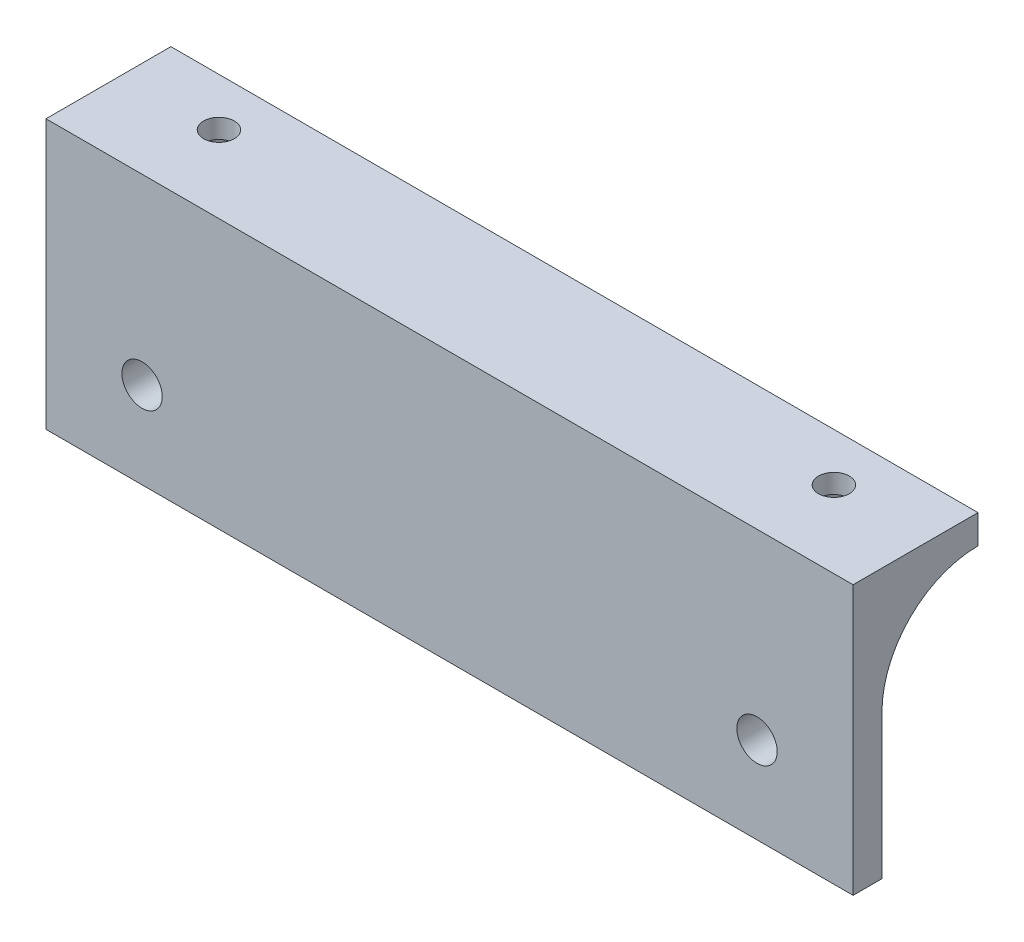
ISO-10303-21;
HEADER;
FILE_DESCRIPTION(('STEP AP214'),'2;1');
FILE_NAME('part.step','',(''),(''),'','','');
FILE_SCHEMA(('AUTOMOTIVE_DESIGN { 1 0 10303 214 1 1 1 1 }'));
ENDSEC;
DATA;
#1=APPLICATION_CONTEXT('core data for automotive mechanical design processes');
#2=APPLICATION_PROTOCOL_DEFINITION('international standard','automotive_design',2000,#1);
#3=PRODUCT_CONTEXT('',#1,'mechanical');
#4=PRODUCT('Part','Part','',(#3));
#5=PRODUCT_RELATED_PRODUCT_CATEGORY('part','',(#4));
#6=PRODUCT_DEFINITION_FORMATION('','',#4);
#7=PRODUCT_DEFINITION_CONTEXT('part definition',#1,'design');
#8=PRODUCT_DEFINITION('design','',#6,#7);
#9=PRODUCT_DEFINITION_SHAPE('','',#8);
#10=(LENGTH_UNIT() NAMED_UNIT(*) SI_UNIT(.MILLI.,.METRE.));
#11=(NAMED_UNIT(*) PLANE_ANGLE_UNIT() SI_UNIT($,.RADIAN.));
#12=(NAMED_UNIT(*) SI_UNIT($,.STERADIAN.) SOLID_ANGLE_UNIT());
#13=UNCERTAINTY_MEASURE_WITH_UNIT(LENGTH_MEASURE(1.E-05),#10,'distance_accuracy_value','');
#14=(GEOMETRIC_REPRESENTATION_CONTEXT(3) GLOBAL_UNCERTAINTY_ASSIGNED_CONTEXT((#13)) GLOBAL_UNIT_ASSIGNED_CONTEXT((#10,
#11,#12)) REPRESENTATION_CONTEXT('',''));
#15=CARTESIAN_POINT('',(0.,0.,0.));
#16=DIRECTION('',(0.,0.,1.));
#17=DIRECTION('',(1.,0.,0.));
#18=AXIS2_PLACEMENT_3D('',#15,#16,#17);
#19=CARTESIAN_POINT('',(32.,11.,-5.00000000000001));
#20=DIRECTION('',(0.,1.,0.));
#21=DIRECTION('',(-1.,0.,0.));
#22=AXIS2_PLACEMENT_3D('',#19,#20,#21);
#23=CYLINDRICAL_SURFACE('',#22,1.60000000000001);
#24=CARTESIAN_POINT('',(32.,14.,-5.00000000000001));
#25=DIRECTION('',(0.,1.,0.));
#26=DIRECTION('',(1.,0.,0.));
#27=AXIS2_PLACEMENT_3D('',#24,#25,#26);
#28=CIRCLE('',#27,1.60000000000001);
#29=CARTESIAN_POINT('',(33.6,14.,-5.00000000000001));
#30=VERTEX_POINT('',#29);
#31=EDGE_CURVE('E180',#30,#30,#28,.T.);
#32=ORIENTED_EDGE('',*,*,#31,.T.);
#33=EDGE_LOOP('',(#32));
#34=FACE_BOUND('',#33,.T.);
#35=CARTESIAN_POINT('',(32.,12.,-5.00000000000001));
#36=DIRECTION('',(0.,-1.,0.));
#37=DIRECTION('',(0.,0.,-1.));
#38=AXIS2_PLACEMENT_3D('',#35,#36,#37);
#39=CIRCLE('',#38,1.60000000000001);
#40=CARTESIAN_POINT('',(32.,12.,-6.60000000000001));
#41=VERTEX_POINT('',#40);
#42=EDGE_CURVE('E181',#41,#41,#39,.F.);
#43=ORIENTED_EDGE('',*,*,#42,.F.);
#44=EDGE_LOOP('',(#43));
#45=FACE_BOUND('',#44,.T.);
#46=ADVANCED_FACE('F33',(#34,#45),#23,.F.);
#47=CARTESIAN_POINT('',(0.,0.,0.));
#48=DIRECTION('',(0.,0.,1.));
#49=DIRECTION('',(1.,0.,0.));
#50=AXIS2_PLACEMENT_3D('',#47,#48,#49);
#51=PLANE('',#50);
#52=CARTESIAN_POINT('',(32.,-4.99999999999999,0.));
#53=DIRECTION('',(0.,0.,1.));
#54=DIRECTION('',(-1.,0.,0.));
#55=AXIS2_PLACEMENT_3D('',#52,#53,#54);
#56=CIRCLE('',#55,2.1);
#57=CARTESIAN_POINT('',(29.9,-4.99999999999999,0.));
#58=VERTEX_POINT('',#57);
#59=EDGE_CURVE('E259',#58,#58,#56,.T.);
#60=ORIENTED_EDGE('',*,*,#59,.T.);
#61=EDGE_LOOP('',(#60));
#62=FACE_BOUND('',#61,.T.);
#63=CARTESIAN_POINT('',(-32.,-5.,0.));
#64=DIRECTION('',(0.,0.,1.));
#65=DIRECTION('',(1.,0.,0.));
#66=AXIS2_PLACEMENT_3D('',#63,#64,#65);
#67=CIRCLE('',#66,2.1);
#68=CARTESIAN_POINT('',(-29.9,-5.,0.));
#69=VERTEX_POINT('',#68);
#70=EDGE_CURVE('E167',#69,#69,#67,.T.);
#71=ORIENTED_EDGE('',*,*,#70,.T.);
#72=EDGE_LOOP('',(#71));
#73=FACE_BOUND('',#72,.T.);
#74=DIRECTION('',(0.,-1.,0.));
#75=VECTOR('',#74,1.);
#76=CARTESIAN_POINT('',(-42.,14.,0.));
#77=LINE('',#76,#75);
#78=CARTESIAN_POINT('',(-42.,1.,0.));
#79=VERTEX_POINT('',#78);
#80=CARTESIAN_POINT('',(-42.,-14.,0.));
#81=VERTEX_POINT('',#80);
#82=EDGE_CURVE('E150',#79,#81,#77,.T.);
#83=ORIENTED_EDGE('',*,*,#82,.F.);
#84=DIRECTION('',(-1.,0.,0.));
#85=VECTOR('',#84,1.);
#86=CARTESIAN_POINT('',(42.,1.00000000000001,0.));
#87=LINE('',#86,#85);
#88=CARTESIAN_POINT('',(42.,1.00000000000001,0.));
#89=VERTEX_POINT('',#88);
#90=EDGE_CURVE('E162',#79,#89,#87,.F.);
#91=ORIENTED_EDGE('',*,*,#90,.T.);
#92=DIRECTION('',(0.,1.,0.));
#93=VECTOR('',#92,1.);
#94=CARTESIAN_POINT('',(42.,14.,0.));
#95=LINE('',#94,#93);
#96=CARTESIAN_POINT('',(42.,-14.,0.));
#97=VERTEX_POINT('',#96);
#98=EDGE_CURVE('E156',#97,#89,#95,.T.);
#99=ORIENTED_EDGE('',*,*,#98,.F.);
#100=DIRECTION('',(1.,0.,0.));
#101=VECTOR('',#100,1.);
#102=CARTESIAN_POINT('',(-42.,-14.,0.));
#103=LINE('',#102,#101);
#104=EDGE_CURVE('E139',#81,#97,#103,.T.);
#105=ORIENTED_EDGE('',*,*,#104,.F.);
#106=EDGE_LOOP('',(#83,#91,#99,#105));
#107=FACE_BOUND('',#106,.T.);
#108=ADVANCED_FACE('F160',(#62,#73,#107),#51,.F.);
#109=CARTESIAN_POINT('',(0.,0.,3.));
#110=DIRECTION('',(0.,0.,1.));
#111=DIRECTION('',(1.,0.,0.));
#112=AXIS2_PLACEMENT_3D('',#109,#110,#111);
#113=PLANE('',#112);
#114=DIRECTION('',(0.,-1.,0.));
#115=VECTOR('',#114,1.);
#116=CARTESIAN_POINT('',(-42.,14.,3.));
#117=LINE('',#116,#115);
#118=CARTESIAN_POINT('',(-42.,14.,3.));
#119=VERTEX_POINT('',#118);
#120=CARTESIAN_POINT('',(-42.,-14.,3.));
#121=VERTEX_POINT('',#120);
#122=EDGE_CURVE('E271',#119,#121,#117,.T.);
#123=ORIENTED_EDGE('',*,*,#122,.T.);
#124=DIRECTION('',(1.,0.,0.));
#125=VECTOR('',#124,1.);
#126=CARTESIAN_POINT('',(-42.,-14.,3.));
#127=LINE('',#126,#125);
#128=CARTESIAN_POINT('',(42.,-14.,3.));
#129=VERTEX_POINT('',#128);
#130=EDGE_CURVE('E158',#121,#129,#127,.T.);
#131=ORIENTED_EDGE('',*,*,#130,.T.);
#132=DIRECTION('',(0.,1.,0.));
#133=VECTOR('',#132,1.);
#134=CARTESIAN_POINT('',(42.,14.,3.));
#135=LINE('',#134,#133);
#136=CARTESIAN_POINT('',(42.,14.,3.));
#137=VERTEX_POINT('',#136);
#138=EDGE_CURVE('E149',#129,#137,#135,.T.);
#139=ORIENTED_EDGE('',*,*,#138,.T.);
#140=DIRECTION('',(-1.,0.,0.));
#141=VECTOR('',#140,1.);
#142=CARTESIAN_POINT('',(-42.,14.,3.));
#143=LINE('',#142,#141);
#144=EDGE_CURVE('E270',#137,#119,#143,.T.);
#145=ORIENTED_EDGE('',*,*,#144,.T.);
#146=EDGE_LOOP('',(#123,#131,#139,#145));
#147=FACE_BOUND('',#146,.T.);
#148=CARTESIAN_POINT('',(32.,-4.99999999999999,3.));
#149=DIRECTION('',(0.,0.,1.));
#150=DIRECTION('',(-1.,0.,0.));
#151=AXIS2_PLACEMENT_3D('',#148,#149,#150);
#152=CIRCLE('',#151,2.1);
#153=CARTESIAN_POINT('',(29.9,-4.99999999999999,3.));
#154=VERTEX_POINT('',#153);
#155=EDGE_CURVE('E262',#154,#154,#152,.T.);
#156=ORIENTED_EDGE('',*,*,#155,.F.);
#157=EDGE_LOOP('',(#156));
#158=FACE_BOUND('',#157,.T.);
#159=CARTESIAN_POINT('',(-32.,-5.,3.));
#160=DIRECTION('',(0.,0.,1.));
#161=DIRECTION('',(1.,0.,0.));
#162=AXIS2_PLACEMENT_3D('',#159,#160,#161);
#163=CIRCLE('',#162,2.1);
#164=CARTESIAN_POINT('',(-29.9,-5.,3.));
#165=VERTEX_POINT('',#164);
#166=EDGE_CURVE('E163',#165,#165,#163,.T.);
#167=ORIENTED_EDGE('',*,*,#166,.F.);
#168=EDGE_LOOP('',(#167));
#169=FACE_BOUND('',#168,.T.);
#170=ADVANCED_FACE('F274',(#147,#158,#169),#113,.T.);
#171=CARTESIAN_POINT('',(42.,14.,3.));
#172=DIRECTION('',(-1.,0.,0.));
#173=DIRECTION('',(0.,-1.,0.));
#174=AXIS2_PLACEMENT_3D('',#171,#172,#173);
#175=PLANE('',#174);
#176=DIRECTION('',(0.,0.,-1.));
#177=VECTOR('',#176,1.);
#178=CARTESIAN_POINT('',(42.,14.,3.));
#179=LINE('',#178,#177);
#180=CARTESIAN_POINT('',(42.,14.,-10.));
#181=VERTEX_POINT('',#180);
#182=EDGE_CURVE('E175',#137,#181,#179,.T.);
#183=ORIENTED_EDGE('',*,*,#182,.F.);
#184=ORIENTED_EDGE('',*,*,#138,.F.);
#185=DIRECTION('',(0.,0.,-1.));
#186=VECTOR('',#185,1.);
#187=CARTESIAN_POINT('',(42.,-14.,3.));
#188=LINE('',#187,#186);
#189=EDGE_CURVE('E143',#129,#97,#188,.T.);
#190=ORIENTED_EDGE('',*,*,#189,.T.);
#191=ORIENTED_EDGE('',*,*,#98,.T.);
#192=CARTESIAN_POINT('',(42.,1.00000000000001,-10.));
#193=DIRECTION('',(-1.,0.,0.));
#194=DIRECTION('',(0.,-1.,0.));
#195=AXIS2_PLACEMENT_3D('',#192,#193,#194);
#196=CIRCLE('',#195,10.);
#197=CARTESIAN_POINT('',(42.,11.,-10.));
#198=VERTEX_POINT('',#197);
#199=EDGE_CURVE('E11',#89,#198,#196,.T.);
#200=ORIENTED_EDGE('',*,*,#199,.T.);
#201=DIRECTION('',(0.,1.,0.));
#202=VECTOR('',#201,1.);
#203=CARTESIAN_POINT('',(42.,11.,-10.));
#204=LINE('',#203,#202);
#205=EDGE_CURVE('E253',#198,#181,#204,.T.);
#206=ORIENTED_EDGE('',*,*,#205,.T.);
#207=EDGE_LOOP('',(#183,#184,#190,#191,#200,#206));
#208=FACE_BOUND('',#207,.T.);
#209=ADVANCED_FACE('F155',(#208),#175,.F.);
#210=CARTESIAN_POINT('',(-42.,14.,3.));
#211=DIRECTION('',(0.,-1.,0.));
#212=DIRECTION('',(1.,0.,0.));
#213=AXIS2_PLACEMENT_3D('',#210,#211,#212);
#214=PLANE('',#213);
#215=ORIENTED_EDGE('',*,*,#182,.T.);
#216=DIRECTION('',(-1.,0.,0.));
#217=VECTOR('',#216,1.);
#218=CARTESIAN_POINT('',(42.,14.,-10.));
#219=LINE('',#218,#217);
#220=CARTESIAN_POINT('',(-42.,14.,-9.99999999999999));
#221=VERTEX_POINT('',#220);
#222=EDGE_CURVE('E249',#181,#221,#219,.T.);
#223=ORIENTED_EDGE('',*,*,#222,.T.);
#224=DIRECTION('',(0.,0.,-1.));
#225=VECTOR('',#224,1.);
#226=CARTESIAN_POINT('',(-42.,14.,3.));
#227=LINE('',#226,#225);
#228=EDGE_CURVE('E173',#119,#221,#227,.T.);
#229=ORIENTED_EDGE('',*,*,#228,.F.);
#230=ORIENTED_EDGE('',*,*,#144,.F.);
#231=EDGE_LOOP('',(#215,#223,#229,#230));
#232=FACE_BOUND('',#231,.T.);
#233=CARTESIAN_POINT('',(-32.,14.,-5.));
#234=DIRECTION('',(0.,1.,0.));
#235=DIRECTION('',(-1.,0.,0.));
#236=AXIS2_PLACEMENT_3D('',#233,#234,#235);
#237=CIRCLE('',#236,1.6);
#238=CARTESIAN_POINT('',(-33.6,14.,-5.));
#239=VERTEX_POINT('',#238);
#240=EDGE_CURVE('E246',#239,#239,#237,.T.);
#241=ORIENTED_EDGE('',*,*,#240,.F.);
#242=EDGE_LOOP('',(#241));
#243=FACE_BOUND('',#242,.T.);
#244=ORIENTED_EDGE('',*,*,#31,.F.);
#245=EDGE_LOOP('',(#244));
#246=FACE_BOUND('',#245,.T.);
#247=ADVANCED_FACE('F279',(#232,#243,#246),#214,.F.);
#248=CARTESIAN_POINT('',(-42.,14.,3.));
#249=DIRECTION('',(1.,0.,0.));
#250=DIRECTION('',(0.,1.,0.));
#251=AXIS2_PLACEMENT_3D('',#248,#249,#250);
#252=PLANE('',#251);
#253=ORIENTED_EDGE('',*,*,#228,.T.);
#254=DIRECTION('',(0.,1.,0.));
#255=VECTOR('',#254,1.);
#256=CARTESIAN_POINT('',(-42.,11.,-9.99999999999999));
#257=LINE('',#256,#255);
#258=CARTESIAN_POINT('',(-42.,11.,-9.99999999999999));
#259=VERTEX_POINT('',#258);
#260=EDGE_CURVE('E256',#259,#221,#257,.T.);
#261=ORIENTED_EDGE('',*,*,#260,.F.);
#262=CARTESIAN_POINT('',(-42.,1.,-10.));
#263=DIRECTION('',(1.,0.,0.));
#264=DIRECTION('',(0.,1.,0.));
#265=AXIS2_PLACEMENT_3D('',#262,#263,#264);
#266=CIRCLE('',#265,10.);
#267=EDGE_CURVE('E43',#259,#79,#266,.T.);
#268=ORIENTED_EDGE('',*,*,#267,.T.);
#269=ORIENTED_EDGE('',*,*,#82,.T.);
#270=DIRECTION('',(0.,0.,-1.));
#271=VECTOR('',#270,1.);
#272=CARTESIAN_POINT('',(-42.,-14.,3.));
#273=LINE('',#272,#271);
#274=EDGE_CURVE('E146',#121,#81,#273,.T.);
#275=ORIENTED_EDGE('',*,*,#274,.F.);
#276=ORIENTED_EDGE('',*,*,#122,.F.);
#277=EDGE_LOOP('',(#253,#261,#268,#269,#275,#276));
#278=FACE_BOUND('',#277,.T.);
#279=ADVANCED_FACE('F286',(#278),#252,.F.);
#280=CARTESIAN_POINT('',(-42.,-14.,3.));
#281=DIRECTION('',(0.,1.,0.));
#282=DIRECTION('',(-1.,0.,0.));
#283=AXIS2_PLACEMENT_3D('',#280,#281,#282);
#284=PLANE('',#283);
#285=ORIENTED_EDGE('',*,*,#104,.T.);
#286=ORIENTED_EDGE('',*,*,#189,.F.);
#287=ORIENTED_EDGE('',*,*,#130,.F.);
#288=ORIENTED_EDGE('',*,*,#274,.T.);
#289=EDGE_LOOP('',(#285,#286,#287,#288));
#290=FACE_BOUND('',#289,.T.);
#291=ADVANCED_FACE('F141',(#290),#284,.F.);
#292=CARTESIAN_POINT('',(-32.,-5.,3.));
#293=DIRECTION('',(0.,0.,-1.));
#294=DIRECTION('',(-1.,0.,0.));
#295=AXIS2_PLACEMENT_3D('',#292,#293,#294);
#296=CYLINDRICAL_SURFACE('',#295,2.1);
#297=ORIENTED_EDGE('',*,*,#166,.T.);
#298=EDGE_LOOP('',(#297));
#299=FACE_BOUND('',#298,.T.);
#300=ORIENTED_EDGE('',*,*,#70,.F.);
#301=EDGE_LOOP('',(#300));
#302=FACE_BOUND('',#301,.T.);
#303=ADVANCED_FACE('F387',(#299,#302),#296,.F.);
#304=CARTESIAN_POINT('',(32.,-4.99999999999999,3.));
#305=DIRECTION('',(0.,0.,-1.));
#306=DIRECTION('',(-1.,0.,0.));
#307=AXIS2_PLACEMENT_3D('',#304,#305,#306);
#308=CYLINDRICAL_SURFACE('',#307,2.1);
#309=ORIENTED_EDGE('',*,*,#155,.T.);
#310=EDGE_LOOP('',(#309));
#311=FACE_BOUND('',#310,.T.);
#312=ORIENTED_EDGE('',*,*,#59,.F.);
#313=EDGE_LOOP('',(#312));
#314=FACE_BOUND('',#313,.T.);
#315=ADVANCED_FACE('F384',(#311,#314),#308,.F.);
#316=CARTESIAN_POINT('',(42.,11.,-10.));
#317=DIRECTION('',(0.,0.,-1.));
#318=DIRECTION('',(-1.,0.,0.));
#319=AXIS2_PLACEMENT_3D('',#316,#317,#318);
#320=PLANE('',#319);
#321=ORIENTED_EDGE('',*,*,#222,.F.);
#322=ORIENTED_EDGE('',*,*,#205,.F.);
#323=DIRECTION('',(-1.,0.,0.));
#324=VECTOR('',#323,1.);
#325=CARTESIAN_POINT('',(42.,11.,-10.));
#326=LINE('',#325,#324);
#327=EDGE_CURVE('E250',#198,#259,#326,.T.);
#328=ORIENTED_EDGE('',*,*,#327,.T.);
#329=ORIENTED_EDGE('',*,*,#260,.T.);
#330=EDGE_LOOP('',(#321,#322,#328,#329));
#331=FACE_BOUND('',#330,.T.);
#332=ADVANCED_FACE('F285',(#331),#320,.T.);
#333=CARTESIAN_POINT('',(-32.,11.,-5.));
#334=DIRECTION('',(0.,1.,0.));
#335=DIRECTION('',(-1.,0.,0.));
#336=AXIS2_PLACEMENT_3D('',#333,#334,#335);
#337=CYLINDRICAL_SURFACE('',#336,1.6);
#338=CARTESIAN_POINT('',(-32.,12.,-5.));
#339=DIRECTION('',(0.,1.,0.));
#340=DIRECTION('',(0.,0.,1.));
#341=AXIS2_PLACEMENT_3D('',#338,#339,#340);
#342=CIRCLE('',#341,1.6);
#343=CARTESIAN_POINT('',(-32.,12.,-3.4));
#344=VERTEX_POINT('',#343);
#345=EDGE_CURVE('E177',#344,#344,#342,.F.);
#346=ORIENTED_EDGE('',*,*,#345,.T.);
#347=EDGE_LOOP('',(#346));
#348=FACE_BOUND('',#347,.T.);
#349=ORIENTED_EDGE('',*,*,#240,.T.);
#350=EDGE_LOOP('',(#349));
#351=FACE_BOUND('',#350,.T.);
#352=ADVANCED_FACE('F378',(#348,#351),#337,.F.);
#353=CARTESIAN_POINT('',(-30.383419246269,2.,-2.2));
#354=DIRECTION('',(0.866025403784439,0.,0.5));
#355=DIRECTION('',(0.5,0.,-0.866025403784439));
#356=AXIS2_PLACEMENT_3D('',#353,#354,#355);
#357=PLANE('',#356);
#358=DIRECTION('',(0.,1.,0.));
#359=VECTOR('',#358,1.);
#360=CARTESIAN_POINT('',(-30.383419246269,2.,-2.2));
#361=LINE('',#360,#359);
#362=CARTESIAN_POINT('',(-30.383419246269,7.25779513886481,-2.2));
#363=VERTEX_POINT('',#362);
#364=CARTESIAN_POINT('',(-30.383419246269,12.,-2.2));
#365=VERTEX_POINT('',#364);
#366=EDGE_CURVE('E104',#363,#365,#361,.T.);
#367=ORIENTED_EDGE('',*,*,#366,.T.);
#368=DIRECTION('',(0.5,0.,-0.866025403784439));
#369=VECTOR('',#368,1.);
#370=CARTESIAN_POINT('',(-30.383419246269,12.,-2.2));
#371=LINE('',#370,#369);
#372=CARTESIAN_POINT('',(-28.7668384925381,12.,-5.));
#373=VERTEX_POINT('',#372);
#374=EDGE_CURVE('E184',#365,#373,#371,.T.);
#375=ORIENTED_EDGE('',*,*,#374,.T.);
#376=DIRECTION('',(0.,1.,0.));
#377=VECTOR('',#376,1.);
#378=CARTESIAN_POINT('',(-28.7668384925381,2.,-5.));
#379=LINE('',#378,#377);
#380=CARTESIAN_POINT('',(-28.7668384925381,9.66025403784439,-5.));
#381=VERTEX_POINT('',#380);
#382=EDGE_CURVE('E221',#381,#373,#379,.T.);
#383=ORIENTED_EDGE('',*,*,#382,.F.);
#384=CARTESIAN_POINT('',(-25.88008714659,1.,-10.));
#385=DIRECTION('',(0.866025403784439,0.,0.5));
#386=DIRECTION('',(0.5,0.,-0.866025403784439));
#387=AXIS2_PLACEMENT_3D('',#384,#385,#386);
#388=ELLIPSE('',#387,11.5470053837925,10.);
#389=EDGE_CURVE('E37',#363,#381,#388,.F.);
#390=ORIENTED_EDGE('',*,*,#389,.F.);
#391=EDGE_LOOP('',(#367,#375,#383,#390));
#392=FACE_BOUND('',#391,.T.);
#393=ADVANCED_FACE('F220',(#392),#357,.F.);
#394=CARTESIAN_POINT('',(-33.616580753731,2.,-2.2));
#395=DIRECTION('',(0.,0.,1.));
#396=DIRECTION('',(1.,0.,0.));
#397=AXIS2_PLACEMENT_3D('',#394,#395,#396);
#398=PLANE('',#397);
#399=DIRECTION('',(0.,1.,0.));
#400=VECTOR('',#399,1.);
#401=CARTESIAN_POINT('',(-33.616580753731,2.,-2.2));
#402=LINE('',#401,#400);
#403=CARTESIAN_POINT('',(-33.616580753731,7.25779513886481,-2.2));
#404=VERTEX_POINT('',#403);
#405=CARTESIAN_POINT('',(-33.616580753731,12.,-2.2));
#406=VERTEX_POINT('',#405);
#407=EDGE_CURVE('E228',#404,#406,#402,.T.);
#408=ORIENTED_EDGE('',*,*,#407,.T.);
#409=DIRECTION('',(1.,0.,0.));
#410=VECTOR('',#409,1.);
#411=CARTESIAN_POINT('',(-33.616580753731,12.,-2.2));
#412=LINE('',#411,#410);
#413=EDGE_CURVE('E227',#406,#365,#412,.T.);
#414=ORIENTED_EDGE('',*,*,#413,.T.);
#415=ORIENTED_EDGE('',*,*,#366,.F.);
#416=DIRECTION('',(1.,0.,0.));
#417=VECTOR('',#416,1.);
#418=CARTESIAN_POINT('',(-32.,7.25779513886481,-2.2));
#419=LINE('',#418,#417);
#420=EDGE_CURVE('E206',#404,#363,#419,.T.);
#421=ORIENTED_EDGE('',*,*,#420,.F.);
#422=EDGE_LOOP('',(#408,#414,#415,#421));
#423=FACE_BOUND('',#422,.T.);
#424=ADVANCED_FACE('F224',(#423),#398,.F.);
#425=CARTESIAN_POINT('',(-35.2331615074619,2.,-5.));
#426=DIRECTION('',(-0.866025403784439,0.,0.5));
#427=DIRECTION('',(0.5,0.,0.866025403784439));
#428=AXIS2_PLACEMENT_3D('',#425,#426,#427);
#429=PLANE('',#428);
#430=DIRECTION('',(0.,1.,0.));
#431=VECTOR('',#430,1.);
#432=CARTESIAN_POINT('',(-35.2331615074619,2.,-5.));
#433=LINE('',#432,#431);
#434=CARTESIAN_POINT('',(-35.2331615074619,9.66025403784439,-5.));
#435=VERTEX_POINT('',#434);
#436=CARTESIAN_POINT('',(-35.2331615074619,12.,-5.));
#437=VERTEX_POINT('',#436);
#438=EDGE_CURVE('E230',#435,#437,#433,.T.);
#439=ORIENTED_EDGE('',*,*,#438,.T.);
#440=DIRECTION('',(0.5,0.,0.866025403784438));
#441=VECTOR('',#440,1.);
#442=CARTESIAN_POINT('',(-35.2331615074619,12.,-5.));
#443=LINE('',#442,#441);
#444=EDGE_CURVE('E333',#437,#406,#443,.T.);
#445=ORIENTED_EDGE('',*,*,#444,.T.);
#446=ORIENTED_EDGE('',*,*,#407,.F.);
#447=CARTESIAN_POINT('',(-38.11991285341,1.,-10.));
#448=DIRECTION('',(-0.866025403784439,0.,0.5));
#449=DIRECTION('',(0.5,0.,0.866025403784439));
#450=AXIS2_PLACEMENT_3D('',#447,#448,#449);
#451=ELLIPSE('',#450,11.5470053837925,10.);
#452=EDGE_CURVE('E209',#435,#404,#451,.F.);
#453=ORIENTED_EDGE('',*,*,#452,.F.);
#454=EDGE_LOOP('',(#439,#445,#446,#453));
#455=FACE_BOUND('',#454,.T.);
#456=ADVANCED_FACE('F337',(#455),#429,.F.);
#457=CARTESIAN_POINT('',(-33.6165807537309,2.,-7.8));
#458=DIRECTION('',(-0.866025403784438,0.,-0.500000000000002));
#459=DIRECTION('',(-0.500000000000002,0.,0.866025403784438));
#460=AXIS2_PLACEMENT_3D('',#457,#458,#459);
#461=PLANE('',#460);
#462=DIRECTION('',(0.,1.,0.));
#463=VECTOR('',#462,1.);
#464=CARTESIAN_POINT('',(-33.6165807537309,2.,-7.8));
#465=LINE('',#464,#463);
#466=CARTESIAN_POINT('',(-33.6165807537309,10.7549987186058,-7.8));
#467=VERTEX_POINT('',#466);
#468=CARTESIAN_POINT('',(-33.6165807537309,12.,-7.8));
#469=VERTEX_POINT('',#468);
#470=EDGE_CURVE('E237',#467,#469,#465,.T.);
#471=ORIENTED_EDGE('',*,*,#470,.T.);
#472=DIRECTION('',(-0.500000000000002,0.,0.866025403784438));
#473=VECTOR('',#472,1.);
#474=CARTESIAN_POINT('',(-33.6165807537309,12.,-7.8));
#475=LINE('',#474,#473);
#476=EDGE_CURVE('E331',#469,#437,#475,.T.);
#477=ORIENTED_EDGE('',*,*,#476,.T.);
#478=ORIENTED_EDGE('',*,*,#438,.F.);
#479=CARTESIAN_POINT('',(-32.3464101615138,1.,-10.));
#480=DIRECTION('',(-0.866025403784438,0.,-0.500000000000002));
#481=DIRECTION('',(0.500000000000002,0.,-0.866025403784438));
#482=AXIS2_PLACEMENT_3D('',#479,#480,#481);
#483=ELLIPSE('',#482,11.5470053837925,10.);
#484=EDGE_CURVE('E212',#467,#435,#483,.F.);
#485=ORIENTED_EDGE('',*,*,#484,.F.);
#486=EDGE_LOOP('',(#471,#477,#478,#485));
#487=FACE_BOUND('',#486,.T.);
#488=ADVANCED_FACE('F354',(#487),#461,.F.);
#489=CARTESIAN_POINT('',(-30.383419246269,2.,-7.8));
#490=DIRECTION('',(0.,0.,-1.));
#491=DIRECTION('',(-1.,0.,0.));
#492=AXIS2_PLACEMENT_3D('',#489,#490,#491);
#493=PLANE('',#492);
#494=DIRECTION('',(0.,1.,0.));
#495=VECTOR('',#494,1.);
#496=CARTESIAN_POINT('',(-30.383419246269,2.,-7.8));
#497=LINE('',#496,#495);
#498=CARTESIAN_POINT('',(-30.383419246269,10.7549987186058,-7.8));
#499=VERTEX_POINT('',#498);
#500=CARTESIAN_POINT('',(-30.383419246269,12.,-7.8));
#501=VERTEX_POINT('',#500);
#502=EDGE_CURVE('E240',#499,#501,#497,.T.);
#503=ORIENTED_EDGE('',*,*,#502,.T.);
#504=DIRECTION('',(-1.,0.,0.));
#505=VECTOR('',#504,1.);
#506=CARTESIAN_POINT('',(-30.383419246269,12.,-7.8));
#507=LINE('',#506,#505);
#508=EDGE_CURVE('E328',#501,#469,#507,.T.);
#509=ORIENTED_EDGE('',*,*,#508,.T.);
#510=ORIENTED_EDGE('',*,*,#470,.F.);
#511=DIRECTION('',(1.,0.,0.));
#512=VECTOR('',#511,1.);
#513=CARTESIAN_POINT('',(-32.,10.7549987186058,-7.8));
#514=LINE('',#513,#512);
#515=EDGE_CURVE('E215',#499,#467,#514,.F.);
#516=ORIENTED_EDGE('',*,*,#515,.F.);
#517=EDGE_LOOP('',(#503,#509,#510,#516));
#518=FACE_BOUND('',#517,.T.);
#519=ADVANCED_FACE('F356',(#518),#493,.F.);
#520=CARTESIAN_POINT('',(-28.7668384925381,2.,-5.));
#521=DIRECTION('',(0.866025403784439,0.,-0.5));
#522=DIRECTION('',(-0.5,0.,-0.866025403784439));
#523=AXIS2_PLACEMENT_3D('',#520,#521,#522);
#524=PLANE('',#523);
#525=ORIENTED_EDGE('',*,*,#382,.T.);
#526=DIRECTION('',(-0.5,0.,-0.866025403784439));
#527=VECTOR('',#526,1.);
#528=CARTESIAN_POINT('',(-28.7668384925381,12.,-5.));
#529=LINE('',#528,#527);
#530=EDGE_CURVE('E325',#373,#501,#529,.T.);
#531=ORIENTED_EDGE('',*,*,#530,.T.);
#532=ORIENTED_EDGE('',*,*,#502,.F.);
#533=CARTESIAN_POINT('',(-31.6535898384862,1.,-10.));
#534=DIRECTION('',(0.866025403784439,0.,-0.5));
#535=DIRECTION('',(0.5,0.,0.866025403784439));
#536=AXIS2_PLACEMENT_3D('',#533,#534,#535);
#537=ELLIPSE('',#536,11.5470053837925,10.);
#538=EDGE_CURVE('E95',#381,#499,#537,.F.);
#539=ORIENTED_EDGE('',*,*,#538,.F.);
#540=EDGE_LOOP('',(#525,#531,#532,#539));
#541=FACE_BOUND('',#540,.T.);
#542=ADVANCED_FACE('F357',(#541),#524,.F.);
#543=CARTESIAN_POINT('',(0.,12.,0.));
#544=DIRECTION('',(0.,1.,0.));
#545=DIRECTION('',(0.,0.,1.));
#546=AXIS2_PLACEMENT_3D('',#543,#544,#545);
#547=PLANE('',#546);
#548=ORIENTED_EDGE('',*,*,#374,.F.);
#549=ORIENTED_EDGE('',*,*,#413,.F.);
#550=ORIENTED_EDGE('',*,*,#444,.F.);
#551=ORIENTED_EDGE('',*,*,#476,.F.);
#552=ORIENTED_EDGE('',*,*,#508,.F.);
#553=ORIENTED_EDGE('',*,*,#530,.F.);
#554=EDGE_LOOP('',(#548,#549,#550,#551,#552,#553));
#555=FACE_BOUND('',#554,.T.);
#556=ORIENTED_EDGE('',*,*,#345,.F.);
#557=EDGE_LOOP('',(#556));
#558=FACE_BOUND('',#557,.T.);
#559=ADVANCED_FACE('F341',(#555,#558),#547,.F.);
#560=CARTESIAN_POINT('',(33.616580753731,2.00000000000001,-2.20000000000001));
#561=DIRECTION('',(0.,0.,1.));
#562=DIRECTION('',(1.,0.,0.));
#563=AXIS2_PLACEMENT_3D('',#560,#561,#562);
#564=PLANE('',#563);
#565=DIRECTION('',(0.,1.,0.));
#566=VECTOR('',#565,1.);
#567=CARTESIAN_POINT('',(30.383419246269,2.00000000000001,-2.20000000000001));
#568=LINE('',#567,#566);
#569=CARTESIAN_POINT('',(30.383419246269,7.25779513886483,-2.20000000000001));
#570=VERTEX_POINT('',#569);
#571=CARTESIAN_POINT('',(30.383419246269,12.,-2.20000000000001));
#572=VERTEX_POINT('',#571);
#573=EDGE_CURVE('E185',#570,#572,#568,.T.);
#574=ORIENTED_EDGE('',*,*,#573,.T.);
#575=DIRECTION('',(1.,0.,0.));
#576=VECTOR('',#575,1.);
#577=CARTESIAN_POINT('',(33.616580753731,12.,-2.20000000000001));
#578=LINE('',#577,#576);
#579=CARTESIAN_POINT('',(33.616580753731,12.,-2.20000000000001));
#580=VERTEX_POINT('',#579);
#581=EDGE_CURVE('E594',#572,#580,#578,.T.);
#582=ORIENTED_EDGE('',*,*,#581,.T.);
#583=DIRECTION('',(0.,1.,0.));
#584=VECTOR('',#583,1.);
#585=CARTESIAN_POINT('',(33.616580753731,2.00000000000001,-2.20000000000001));
#586=LINE('',#585,#584);
#587=CARTESIAN_POINT('',(33.616580753731,7.25779513886483,-2.20000000000001));
#588=VERTEX_POINT('',#587);
#589=EDGE_CURVE('E320',#588,#580,#586,.T.);
#590=ORIENTED_EDGE('',*,*,#589,.F.);
#591=DIRECTION('',(1.,0.,0.));
#592=VECTOR('',#591,1.);
#593=CARTESIAN_POINT('',(32.,7.25779513886483,-2.20000000000001));
#594=LINE('',#593,#592);
#595=EDGE_CURVE('E187',#570,#588,#594,.T.);
#596=ORIENTED_EDGE('',*,*,#595,.F.);
#597=EDGE_LOOP('',(#574,#582,#590,#596));
#598=FACE_BOUND('',#597,.T.);
#599=ADVANCED_FACE('F364',(#598),#564,.F.);
#600=CARTESIAN_POINT('',(30.383419246269,2.00000000000001,-2.20000000000001));
#601=DIRECTION('',(-0.866025403784439,0.,0.5));
#602=DIRECTION('',(0.5,0.,0.866025403784439));
#603=AXIS2_PLACEMENT_3D('',#600,#601,#602);
#604=PLANE('',#603);
#605=DIRECTION('',(0.,1.,0.));
#606=VECTOR('',#605,1.);
#607=CARTESIAN_POINT('',(28.7668384925381,2.00000000000001,-5.00000000000001));
#608=LINE('',#607,#606);
#609=CARTESIAN_POINT('',(28.7668384925381,9.6602540378444,-5.00000000000001));
#610=VERTEX_POINT('',#609);
#611=CARTESIAN_POINT('',(28.7668384925381,12.,-5.00000000000001));
#612=VERTEX_POINT('',#611);
#613=EDGE_CURVE('E298',#610,#612,#608,.T.);
#614=ORIENTED_EDGE('',*,*,#613,.T.);
#615=DIRECTION('',(0.5,0.,0.866025403784439));
#616=VECTOR('',#615,1.);
#617=CARTESIAN_POINT('',(30.383419246269,12.,-2.20000000000001));
#618=LINE('',#617,#616);
#619=EDGE_CURVE('E323',#612,#572,#618,.T.);
#620=ORIENTED_EDGE('',*,*,#619,.T.);
#621=ORIENTED_EDGE('',*,*,#573,.F.);
#622=CARTESIAN_POINT('',(25.88008714659,1.00000000000001,-10.));
#623=DIRECTION('',(-0.866025403784439,0.,0.5));
#624=DIRECTION('',(0.5,0.,0.866025403784439));
#625=AXIS2_PLACEMENT_3D('',#622,#623,#624);
#626=ELLIPSE('',#625,11.5470053837925,10.);
#627=EDGE_CURVE('E189',#610,#570,#626,.F.);
#628=ORIENTED_EDGE('',*,*,#627,.F.);
#629=EDGE_LOOP('',(#614,#620,#621,#628));
#630=FACE_BOUND('',#629,.T.);
#631=ADVANCED_FACE('F295',(#630),#604,.F.);
#632=CARTESIAN_POINT('',(28.7668384925381,2.00000000000001,-5.00000000000001));
#633=DIRECTION('',(-0.866025403784439,0.,-0.5));
#634=DIRECTION('',(-0.5,0.,0.866025403784439));
#635=AXIS2_PLACEMENT_3D('',#632,#633,#634);
#636=PLANE('',#635);
#637=DIRECTION('',(0.,1.,0.));
#638=VECTOR('',#637,1.);
#639=CARTESIAN_POINT('',(30.383419246269,2.00000000000001,-7.80000000000001));
#640=LINE('',#639,#638);
#641=CARTESIAN_POINT('',(30.383419246269,10.7549987186058,-7.80000000000001));
#642=VERTEX_POINT('',#641);
#643=CARTESIAN_POINT('',(30.383419246269,12.,-7.80000000000001));
#644=VERTEX_POINT('',#643);
#645=EDGE_CURVE('E308',#642,#644,#640,.T.);
#646=ORIENTED_EDGE('',*,*,#645,.T.);
#647=DIRECTION('',(-0.5,0.,0.866025403784439));
#648=VECTOR('',#647,1.);
#649=CARTESIAN_POINT('',(28.7668384925381,12.,-5.00000000000001));
#650=LINE('',#649,#648);
#651=EDGE_CURVE('E306',#644,#612,#650,.T.);
#652=ORIENTED_EDGE('',*,*,#651,.T.);
#653=ORIENTED_EDGE('',*,*,#613,.F.);
#654=CARTESIAN_POINT('',(31.6535898384862,1.00000000000001,-10.));
#655=DIRECTION('',(-0.866025403784439,0.,-0.5));
#656=DIRECTION('',(0.5,0.,-0.866025403784439));
#657=AXIS2_PLACEMENT_3D('',#654,#655,#656);
#658=ELLIPSE('',#657,11.5470053837925,10.);
#659=EDGE_CURVE('E192',#642,#610,#658,.F.);
#660=ORIENTED_EDGE('',*,*,#659,.F.);
#661=EDGE_LOOP('',(#646,#652,#653,#660));
#662=FACE_BOUND('',#661,.T.);
#663=ADVANCED_FACE('F303',(#662),#636,.F.);
#664=CARTESIAN_POINT('',(30.383419246269,2.00000000000001,-7.80000000000001));
#665=DIRECTION('',(0.,0.,-1.));
#666=DIRECTION('',(-1.,0.,0.));
#667=AXIS2_PLACEMENT_3D('',#664,#665,#666);
#668=PLANE('',#667);
#669=DIRECTION('',(0.,1.,0.));
#670=VECTOR('',#669,1.);
#671=CARTESIAN_POINT('',(33.6165807537309,2.00000000000001,-7.80000000000001));
#672=LINE('',#671,#670);
#673=CARTESIAN_POINT('',(33.6165807537309,10.7549987186058,-7.80000000000001));
#674=VERTEX_POINT('',#673);
#675=CARTESIAN_POINT('',(33.6165807537309,12.,-7.80000000000001));
#676=VERTEX_POINT('',#675);
#677=EDGE_CURVE('E311',#674,#676,#672,.T.);
#678=ORIENTED_EDGE('',*,*,#677,.T.);
#679=DIRECTION('',(-1.,0.,0.));
#680=VECTOR('',#679,1.);
#681=CARTESIAN_POINT('',(30.383419246269,12.,-7.80000000000001));
#682=LINE('',#681,#680);
#683=EDGE_CURVE('E602',#676,#644,#682,.T.);
#684=ORIENTED_EDGE('',*,*,#683,.T.);
#685=ORIENTED_EDGE('',*,*,#645,.F.);
#686=DIRECTION('',(1.,0.,0.));
#687=VECTOR('',#686,1.);
#688=CARTESIAN_POINT('',(32.,10.7549987186058,-7.80000000000001));
#689=LINE('',#688,#687);
#690=EDGE_CURVE('E195',#674,#642,#689,.F.);
#691=ORIENTED_EDGE('',*,*,#690,.F.);
#692=EDGE_LOOP('',(#678,#684,#685,#691));
#693=FACE_BOUND('',#692,.T.);
#694=ADVANCED_FACE('F492',(#693),#668,.F.);
#695=CARTESIAN_POINT('',(33.6165807537309,2.00000000000001,-7.80000000000001));
#696=DIRECTION('',(0.866025403784438,0.,-0.500000000000002));
#697=DIRECTION('',(-0.500000000000002,0.,-0.866025403784438));
#698=AXIS2_PLACEMENT_3D('',#695,#696,#697);
#699=PLANE('',#698);
#700=DIRECTION('',(0.,1.,0.));
#701=VECTOR('',#700,1.);
#702=CARTESIAN_POINT('',(35.2331615074619,2.00000000000001,-5.00000000000001));
#703=LINE('',#702,#701);
#704=CARTESIAN_POINT('',(35.2331615074619,9.66025403784441,-5.00000000000001));
#705=VERTEX_POINT('',#704);
#706=CARTESIAN_POINT('',(35.2331615074619,12.,-5.00000000000001));
#707=VERTEX_POINT('',#706);
#708=EDGE_CURVE('E317',#705,#707,#703,.T.);
#709=ORIENTED_EDGE('',*,*,#708,.T.);
#710=DIRECTION('',(-0.500000000000002,0.,-0.866025403784438));
#711=VECTOR('',#710,1.);
#712=CARTESIAN_POINT('',(33.6165807537309,12.,-7.80000000000001));
#713=LINE('',#712,#711);
#714=EDGE_CURVE('E607',#707,#676,#713,.T.);
#715=ORIENTED_EDGE('',*,*,#714,.T.);
#716=ORIENTED_EDGE('',*,*,#677,.F.);
#717=CARTESIAN_POINT('',(32.3464101615138,1.00000000000001,-10.));
#718=DIRECTION('',(0.866025403784438,0.,-0.500000000000002));
#719=DIRECTION('',(0.500000000000002,0.,0.866025403784438));
#720=AXIS2_PLACEMENT_3D('',#717,#718,#719);
#721=ELLIPSE('',#720,11.5470053837925,10.);
#722=EDGE_CURVE('E198',#705,#674,#721,.F.);
#723=ORIENTED_EDGE('',*,*,#722,.F.);
#724=EDGE_LOOP('',(#709,#715,#716,#723));
#725=FACE_BOUND('',#724,.T.);
#726=ADVANCED_FACE('F501',(#725),#699,.F.);
#727=CARTESIAN_POINT('',(35.2331615074619,2.00000000000001,-5.00000000000001));
#728=DIRECTION('',(0.866025403784439,0.,0.5));
#729=DIRECTION('',(0.5,0.,-0.866025403784439));
#730=AXIS2_PLACEMENT_3D('',#727,#728,#729);
#731=PLANE('',#730);
#732=ORIENTED_EDGE('',*,*,#589,.T.);
#733=DIRECTION('',(0.5,0.,-0.866025403784439));
#734=VECTOR('',#733,1.);
#735=CARTESIAN_POINT('',(35.2331615074619,12.,-5.00000000000001));
#736=LINE('',#735,#734);
#737=EDGE_CURVE('E599',#580,#707,#736,.T.);
#738=ORIENTED_EDGE('',*,*,#737,.T.);
#739=ORIENTED_EDGE('',*,*,#708,.F.);
#740=CARTESIAN_POINT('',(38.11991285341,1.00000000000001,-10.));
#741=DIRECTION('',(0.866025403784439,0.,0.5));
#742=DIRECTION('',(0.5,0.,-0.866025403784439));
#743=AXIS2_PLACEMENT_3D('',#740,#741,#742);
#744=ELLIPSE('',#743,11.5470053837925,10.);
#745=EDGE_CURVE('E201',#588,#705,#744,.F.);
#746=ORIENTED_EDGE('',*,*,#745,.F.);
#747=EDGE_LOOP('',(#732,#738,#739,#746));
#748=FACE_BOUND('',#747,.T.);
#749=ADVANCED_FACE('F511',(#748),#731,.F.);
#750=CARTESIAN_POINT('',(0.,12.,0.));
#751=DIRECTION('',(0.,-1.,0.));
#752=DIRECTION('',(0.,0.,-1.));
#753=AXIS2_PLACEMENT_3D('',#750,#751,#752);
#754=PLANE('',#753);
#755=ORIENTED_EDGE('',*,*,#581,.F.);
#756=ORIENTED_EDGE('',*,*,#619,.F.);
#757=ORIENTED_EDGE('',*,*,#651,.F.);
#758=ORIENTED_EDGE('',*,*,#683,.F.);
#759=ORIENTED_EDGE('',*,*,#714,.F.);
#760=ORIENTED_EDGE('',*,*,#737,.F.);
#761=EDGE_LOOP('',(#755,#756,#757,#758,#759,#760));
#762=FACE_BOUND('',#761,.T.);
#763=ORIENTED_EDGE('',*,*,#42,.T.);
#764=EDGE_LOOP('',(#763));
#765=FACE_BOUND('',#764,.T.);
#766=ADVANCED_FACE('F290',(#762,#765),#754,.T.);
#767=CARTESIAN_POINT('',(0.,1.00000000000001,-10.));
#768=DIRECTION('',(1.,0.,0.));
#769=DIRECTION('',(0.,1.,0.));
#770=AXIS2_PLACEMENT_3D('',#767,#768,#769);
#771=CYLINDRICAL_SURFACE('',#770,10.);
#772=ORIENTED_EDGE('',*,*,#199,.F.);
#773=ORIENTED_EDGE('',*,*,#90,.F.);
#774=ORIENTED_EDGE('',*,*,#267,.F.);
#775=ORIENTED_EDGE('',*,*,#327,.F.);
#776=EDGE_LOOP('',(#772,#773,#774,#775));
#777=FACE_BOUND('',#776,.T.);
#778=ORIENTED_EDGE('',*,*,#627,.T.);
#779=ORIENTED_EDGE('',*,*,#595,.T.);
#780=ORIENTED_EDGE('',*,*,#745,.T.);
#781=ORIENTED_EDGE('',*,*,#722,.T.);
#782=ORIENTED_EDGE('',*,*,#690,.T.);
#783=ORIENTED_EDGE('',*,*,#659,.T.);
#784=EDGE_LOOP('',(#778,#779,#780,#781,#782,#783));
#785=FACE_BOUND('',#784,.T.);
#786=ORIENTED_EDGE('',*,*,#420,.T.);
#787=ORIENTED_EDGE('',*,*,#389,.T.);
#788=ORIENTED_EDGE('',*,*,#538,.T.);
#789=ORIENTED_EDGE('',*,*,#515,.T.);
#790=ORIENTED_EDGE('',*,*,#484,.T.);
#791=ORIENTED_EDGE('',*,*,#452,.T.);
#792=EDGE_LOOP('',(#786,#787,#788,#789,#790,#791));
#793=FACE_BOUND('',#792,.T.);
#794=ADVANCED_FACE('F35',(#777,#785,#793),#771,.F.);
#795=CLOSED_SHELL('',(#46,#108,#170,#209,#247,#279,#291,#303,#315,#332,#352,#393,#424,#456,#488,
#519,#542,#559,#599,#631,#663,#694,#726,#749,#766,#794));
#796=MANIFOLD_SOLID_BREP('B2',#795);
#797=ADVANCED_BREP_SHAPE_REPRESENTATION('',(#18,#796),#14);
#798=SHAPE_DEFINITION_REPRESENTATION(#9,#797);
ENDSEC;
END-ISO-10303-21;
